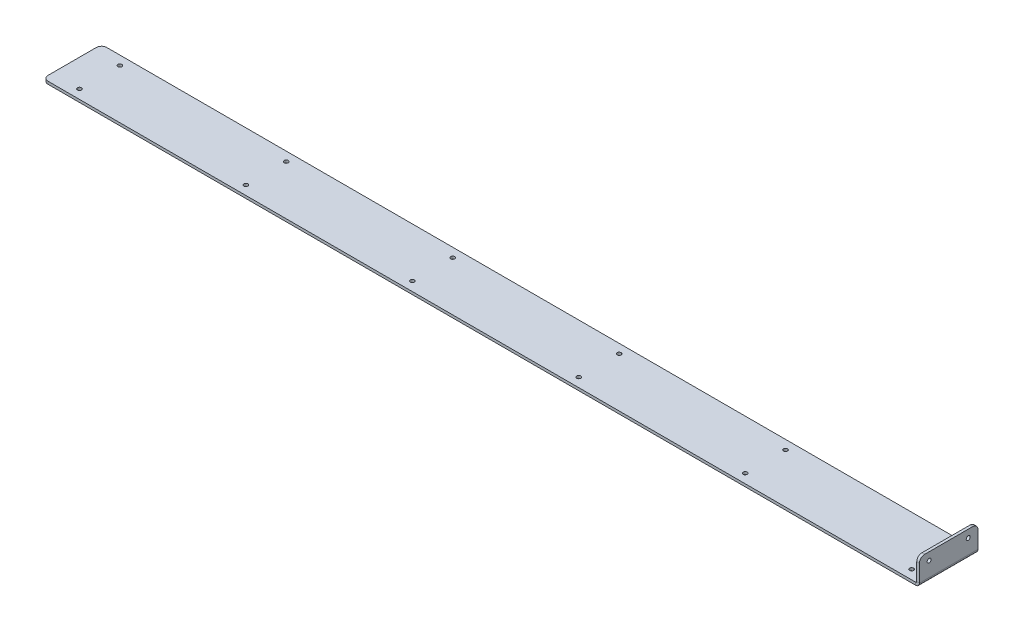
ISO-10303-21;
HEADER;
FILE_DESCRIPTION(('STEP AP214'),'2;1');
FILE_NAME('part.step','',(''),(''),'','','');
FILE_SCHEMA(('AUTOMOTIVE_DESIGN { 1 0 10303 214 1 1 1 1 }'));
ENDSEC;
DATA;
#1=APPLICATION_CONTEXT('core data for automotive mechanical design processes');
#2=APPLICATION_PROTOCOL_DEFINITION('international standard','automotive_design',2000,#1);
#3=PRODUCT_CONTEXT('',#1,'mechanical');
#4=PRODUCT('Part','Part','',(#3));
#5=PRODUCT_RELATED_PRODUCT_CATEGORY('part','',(#4));
#6=PRODUCT_DEFINITION_FORMATION('','',#4);
#7=PRODUCT_DEFINITION_CONTEXT('part definition',#1,'design');
#8=PRODUCT_DEFINITION('design','',#6,#7);
#9=PRODUCT_DEFINITION_SHAPE('','',#8);
#10=(LENGTH_UNIT() NAMED_UNIT(*) SI_UNIT(.MILLI.,.METRE.));
#11=(NAMED_UNIT(*) PLANE_ANGLE_UNIT() SI_UNIT($,.RADIAN.));
#12=(NAMED_UNIT(*) SI_UNIT($,.STERADIAN.) SOLID_ANGLE_UNIT());
#13=UNCERTAINTY_MEASURE_WITH_UNIT(LENGTH_MEASURE(1.E-05),#10,'distance_accuracy_value','');
#14=(GEOMETRIC_REPRESENTATION_CONTEXT(3) GLOBAL_UNCERTAINTY_ASSIGNED_CONTEXT((#13)) GLOBAL_UNIT_ASSIGNED_CONTEXT((#10,
#11,#12)) REPRESENTATION_CONTEXT('',''));
#15=CARTESIAN_POINT('',(0.,0.,0.));
#16=DIRECTION('',(0.,0.,1.));
#17=DIRECTION('',(1.,0.,0.));
#18=AXIS2_PLACEMENT_3D('',#15,#16,#17);
#19=CARTESIAN_POINT('',(-1030.5161,0.,24.6062500000006));
#20=DIRECTION('',(0.,1.,0.));
#21=DIRECTION('',(0.,0.,1.));
#22=AXIS2_PLACEMENT_3D('',#19,#20,#21);
#23=CYLINDRICAL_SURFACE('',#22,2.45744999999999);
#24=CARTESIAN_POINT('',(-1030.5161,-3.2639,24.6062500000006));
#25=DIRECTION('',(0.,1.,0.));
#26=DIRECTION('',(0.,0.,1.));
#27=AXIS2_PLACEMENT_3D('',#24,#25,#26);
#28=CIRCLE('',#27,2.45744999999999);
#29=CARTESIAN_POINT('',(-1030.5161,-3.2639,27.0637000000006));
#30=VERTEX_POINT('',#29);
#31=EDGE_CURVE('E274',#30,#30,#28,.T.);
#32=ORIENTED_EDGE('',*,*,#31,.F.);
#33=EDGE_LOOP('',(#32));
#34=FACE_BOUND('',#33,.T.);
#35=CARTESIAN_POINT('',(-1030.5161,0.,24.6062500000006));
#36=DIRECTION('',(0.,1.,0.));
#37=DIRECTION('',(0.,0.,1.));
#38=AXIS2_PLACEMENT_3D('',#35,#36,#37);
#39=CIRCLE('',#38,2.45744999999999);
#40=CARTESIAN_POINT('',(-1030.5161,0.,27.0637000000006));
#41=VERTEX_POINT('',#40);
#42=EDGE_CURVE('E277',#41,#41,#39,.T.);
#43=ORIENTED_EDGE('',*,*,#42,.T.);
#44=EDGE_LOOP('',(#43));
#45=FACE_BOUND('',#44,.T.);
#46=ADVANCED_FACE('F58',(#34,#45),#23,.F.);
#47=CARTESIAN_POINT('',(-827.6336,0.,24.6062500000005));
#48=DIRECTION('',(0.,1.,0.));
#49=DIRECTION('',(0.,0.,1.));
#50=AXIS2_PLACEMENT_3D('',#47,#48,#49);
#51=CYLINDRICAL_SURFACE('',#50,2.45744999999999);
#52=CARTESIAN_POINT('',(-827.6336,-3.2639,24.6062500000005));
#53=DIRECTION('',(0.,1.,0.));
#54=DIRECTION('',(0.,0.,1.));
#55=AXIS2_PLACEMENT_3D('',#52,#53,#54);
#56=CIRCLE('',#55,2.45744999999999);
#57=CARTESIAN_POINT('',(-827.6336,-3.2639,27.0637000000005));
#58=VERTEX_POINT('',#57);
#59=EDGE_CURVE('E268',#58,#58,#56,.T.);
#60=ORIENTED_EDGE('',*,*,#59,.F.);
#61=EDGE_LOOP('',(#60));
#62=FACE_BOUND('',#61,.T.);
#63=CARTESIAN_POINT('',(-827.6336,0.,24.6062500000005));
#64=DIRECTION('',(0.,1.,0.));
#65=DIRECTION('',(0.,0.,1.));
#66=AXIS2_PLACEMENT_3D('',#63,#64,#65);
#67=CIRCLE('',#66,2.45744999999999);
#68=CARTESIAN_POINT('',(-827.6336,0.,27.0637000000005));
#69=VERTEX_POINT('',#68);
#70=EDGE_CURVE('E271',#69,#69,#67,.T.);
#71=ORIENTED_EDGE('',*,*,#70,.T.);
#72=EDGE_LOOP('',(#71));
#73=FACE_BOUND('',#72,.T.);
#74=ADVANCED_FACE('F357',(#62,#73),#51,.F.);
#75=CARTESIAN_POINT('',(-624.7511,0.,24.6062500000004));
#76=DIRECTION('',(0.,1.,0.));
#77=DIRECTION('',(0.,0.,1.));
#78=AXIS2_PLACEMENT_3D('',#75,#76,#77);
#79=CYLINDRICAL_SURFACE('',#78,2.45744999999999);
#80=CARTESIAN_POINT('',(-624.7511,-3.2639,24.6062500000004));
#81=DIRECTION('',(0.,1.,0.));
#82=DIRECTION('',(0.,0.,1.));
#83=AXIS2_PLACEMENT_3D('',#80,#81,#82);
#84=CIRCLE('',#83,2.45744999999999);
#85=CARTESIAN_POINT('',(-624.7511,-3.2639,27.0637000000004));
#86=VERTEX_POINT('',#85);
#87=EDGE_CURVE('E262',#86,#86,#84,.T.);
#88=ORIENTED_EDGE('',*,*,#87,.F.);
#89=EDGE_LOOP('',(#88));
#90=FACE_BOUND('',#89,.T.);
#91=CARTESIAN_POINT('',(-624.7511,0.,24.6062500000004));
#92=DIRECTION('',(0.,1.,0.));
#93=DIRECTION('',(0.,0.,1.));
#94=AXIS2_PLACEMENT_3D('',#91,#92,#93);
#95=CIRCLE('',#94,2.45744999999999);
#96=CARTESIAN_POINT('',(-624.7511,0.,27.0637000000004));
#97=VERTEX_POINT('',#96);
#98=EDGE_CURVE('E265',#97,#97,#95,.T.);
#99=ORIENTED_EDGE('',*,*,#98,.T.);
#100=EDGE_LOOP('',(#99));
#101=FACE_BOUND('',#100,.T.);
#102=ADVANCED_FACE('F363',(#90,#101),#79,.F.);
#103=CARTESIAN_POINT('',(-421.8686,0.,24.6062500000002));
#104=DIRECTION('',(0.,1.,0.));
#105=DIRECTION('',(0.,0.,1.));
#106=AXIS2_PLACEMENT_3D('',#103,#104,#105);
#107=CYLINDRICAL_SURFACE('',#106,2.45744999999999);
#108=CARTESIAN_POINT('',(-421.8686,-3.2639,24.6062500000002));
#109=DIRECTION('',(0.,1.,0.));
#110=DIRECTION('',(0.,0.,1.));
#111=AXIS2_PLACEMENT_3D('',#108,#109,#110);
#112=CIRCLE('',#111,2.45744999999999);
#113=CARTESIAN_POINT('',(-421.8686,-3.2639,27.0637000000002));
#114=VERTEX_POINT('',#113);
#115=EDGE_CURVE('E256',#114,#114,#112,.T.);
#116=ORIENTED_EDGE('',*,*,#115,.F.);
#117=EDGE_LOOP('',(#116));
#118=FACE_BOUND('',#117,.T.);
#119=CARTESIAN_POINT('',(-421.8686,0.,24.6062500000002));
#120=DIRECTION('',(0.,1.,0.));
#121=DIRECTION('',(0.,0.,1.));
#122=AXIS2_PLACEMENT_3D('',#119,#120,#121);
#123=CIRCLE('',#122,2.45744999999999);
#124=CARTESIAN_POINT('',(-421.8686,0.,27.0637000000002));
#125=VERTEX_POINT('',#124);
#126=EDGE_CURVE('E259',#125,#125,#123,.T.);
#127=ORIENTED_EDGE('',*,*,#126,.T.);
#128=EDGE_LOOP('',(#127));
#129=FACE_BOUND('',#128,.T.);
#130=ADVANCED_FACE('F371',(#118,#129),#107,.F.);
#131=CARTESIAN_POINT('',(-1030.5161,0.,-24.6062499999994));
#132=DIRECTION('',(0.,1.,0.));
#133=DIRECTION('',(0.,0.,1.));
#134=AXIS2_PLACEMENT_3D('',#131,#132,#133);
#135=CYLINDRICAL_SURFACE('',#134,2.45744999999999);
#136=CARTESIAN_POINT('',(-1030.5161,-3.2639,-24.6062499999994));
#137=DIRECTION('',(0.,1.,0.));
#138=DIRECTION('',(0.,0.,1.));
#139=AXIS2_PLACEMENT_3D('',#136,#137,#138);
#140=CIRCLE('',#139,2.45744999999999);
#141=CARTESIAN_POINT('',(-1030.5161,-3.2639,-22.1487999999994));
#142=VERTEX_POINT('',#141);
#143=EDGE_CURVE('E250',#142,#142,#140,.T.);
#144=ORIENTED_EDGE('',*,*,#143,.F.);
#145=EDGE_LOOP('',(#144));
#146=FACE_BOUND('',#145,.T.);
#147=CARTESIAN_POINT('',(-1030.5161,0.,-24.6062499999994));
#148=DIRECTION('',(0.,1.,0.));
#149=DIRECTION('',(0.,0.,1.));
#150=AXIS2_PLACEMENT_3D('',#147,#148,#149);
#151=CIRCLE('',#150,2.45744999999999);
#152=CARTESIAN_POINT('',(-1030.5161,0.,-22.1487999999994));
#153=VERTEX_POINT('',#152);
#154=EDGE_CURVE('E253',#153,#153,#151,.T.);
#155=ORIENTED_EDGE('',*,*,#154,.T.);
#156=EDGE_LOOP('',(#155));
#157=FACE_BOUND('',#156,.T.);
#158=ADVANCED_FACE('F375',(#146,#157),#135,.F.);
#159=CARTESIAN_POINT('',(-827.6336,0.,-24.6062499999995));
#160=DIRECTION('',(0.,1.,0.));
#161=DIRECTION('',(0.,0.,1.));
#162=AXIS2_PLACEMENT_3D('',#159,#160,#161);
#163=CYLINDRICAL_SURFACE('',#162,2.45744999999999);
#164=CARTESIAN_POINT('',(-827.6336,-3.2639,-24.6062499999995));
#165=DIRECTION('',(0.,1.,0.));
#166=DIRECTION('',(0.,0.,1.));
#167=AXIS2_PLACEMENT_3D('',#164,#165,#166);
#168=CIRCLE('',#167,2.45744999999999);
#169=CARTESIAN_POINT('',(-827.6336,-3.2639,-22.1487999999995));
#170=VERTEX_POINT('',#169);
#171=EDGE_CURVE('E244',#170,#170,#168,.T.);
#172=ORIENTED_EDGE('',*,*,#171,.F.);
#173=EDGE_LOOP('',(#172));
#174=FACE_BOUND('',#173,.T.);
#175=CARTESIAN_POINT('',(-827.6336,0.,-24.6062499999995));
#176=DIRECTION('',(0.,1.,0.));
#177=DIRECTION('',(0.,0.,1.));
#178=AXIS2_PLACEMENT_3D('',#175,#176,#177);
#179=CIRCLE('',#178,2.45744999999999);
#180=CARTESIAN_POINT('',(-827.6336,0.,-22.1487999999995));
#181=VERTEX_POINT('',#180);
#182=EDGE_CURVE('E247',#181,#181,#179,.T.);
#183=ORIENTED_EDGE('',*,*,#182,.T.);
#184=EDGE_LOOP('',(#183));
#185=FACE_BOUND('',#184,.T.);
#186=ADVANCED_FACE('F379',(#174,#185),#163,.F.);
#187=CARTESIAN_POINT('',(-624.7511,0.,-24.6062499999996));
#188=DIRECTION('',(0.,1.,0.));
#189=DIRECTION('',(0.,0.,1.));
#190=AXIS2_PLACEMENT_3D('',#187,#188,#189);
#191=CYLINDRICAL_SURFACE('',#190,2.45744999999999);
#192=CARTESIAN_POINT('',(-624.7511,-3.2639,-24.6062499999996));
#193=DIRECTION('',(0.,1.,0.));
#194=DIRECTION('',(0.,0.,1.));
#195=AXIS2_PLACEMENT_3D('',#192,#193,#194);
#196=CIRCLE('',#195,2.45744999999999);
#197=CARTESIAN_POINT('',(-624.7511,-3.2639,-22.1487999999996));
#198=VERTEX_POINT('',#197);
#199=EDGE_CURVE('E238',#198,#198,#196,.T.);
#200=ORIENTED_EDGE('',*,*,#199,.F.);
#201=EDGE_LOOP('',(#200));
#202=FACE_BOUND('',#201,.T.);
#203=CARTESIAN_POINT('',(-624.7511,0.,-24.6062499999996));
#204=DIRECTION('',(0.,1.,0.));
#205=DIRECTION('',(0.,0.,1.));
#206=AXIS2_PLACEMENT_3D('',#203,#204,#205);
#207=CIRCLE('',#206,2.45744999999999);
#208=CARTESIAN_POINT('',(-624.7511,0.,-22.1487999999996));
#209=VERTEX_POINT('',#208);
#210=EDGE_CURVE('E241',#209,#209,#207,.T.);
#211=ORIENTED_EDGE('',*,*,#210,.T.);
#212=EDGE_LOOP('',(#211));
#213=FACE_BOUND('',#212,.T.);
#214=ADVANCED_FACE('F383',(#202,#213),#191,.F.);
#215=CARTESIAN_POINT('',(-421.8686,0.,-24.6062499999998));
#216=DIRECTION('',(0.,1.,0.));
#217=DIRECTION('',(0.,0.,1.));
#218=AXIS2_PLACEMENT_3D('',#215,#216,#217);
#219=CYLINDRICAL_SURFACE('',#218,2.45744999999999);
#220=CARTESIAN_POINT('',(-421.8686,-3.2639,-24.6062499999998));
#221=DIRECTION('',(0.,1.,0.));
#222=DIRECTION('',(0.,0.,1.));
#223=AXIS2_PLACEMENT_3D('',#220,#221,#222);
#224=CIRCLE('',#223,2.45744999999999);
#225=CARTESIAN_POINT('',(-421.8686,-3.2639,-22.1487999999998));
#226=VERTEX_POINT('',#225);
#227=EDGE_CURVE('E230',#226,#226,#224,.T.);
#228=ORIENTED_EDGE('',*,*,#227,.F.);
#229=EDGE_LOOP('',(#228));
#230=FACE_BOUND('',#229,.T.);
#231=CARTESIAN_POINT('',(-421.8686,0.,-24.6062499999998));
#232=DIRECTION('',(0.,1.,0.));
#233=DIRECTION('',(0.,0.,1.));
#234=AXIS2_PLACEMENT_3D('',#231,#232,#233);
#235=CIRCLE('',#234,2.45744999999999);
#236=CARTESIAN_POINT('',(-421.8686,0.,-22.1487999999998));
#237=VERTEX_POINT('',#236);
#238=EDGE_CURVE('E235',#237,#237,#235,.T.);
#239=ORIENTED_EDGE('',*,*,#238,.T.);
#240=EDGE_LOOP('',(#239));
#241=FACE_BOUND('',#240,.T.);
#242=ADVANCED_FACE('F387',(#230,#241),#219,.F.);
#243=CARTESIAN_POINT('',(-1063.92345,-3.2639,-35.7187499999993));
#244=DIRECTION('',(-1.,0.,0.));
#245=DIRECTION('',(0.,0.,1.));
#246=AXIS2_PLACEMENT_3D('',#243,#244,#245);
#247=PLANE('',#246);
#248=DIRECTION('',(0.,0.,1.));
#249=VECTOR('',#248,1.);
#250=CARTESIAN_POINT('',(-1063.92345,-3.2639,-35.7187499999993));
#251=LINE('',#250,#249);
#252=CARTESIAN_POINT('',(-1063.92345,-3.2639,-29.3687499999994));
#253=VERTEX_POINT('',#252);
#254=CARTESIAN_POINT('',(-1063.92345,-3.2639,29.36875));
#255=VERTEX_POINT('',#254);
#256=EDGE_CURVE('E210',#253,#255,#251,.T.);
#257=ORIENTED_EDGE('',*,*,#256,.T.);
#258=DIRECTION('',(0.,1.,0.));
#259=VECTOR('',#258,1.);
#260=CARTESIAN_POINT('',(-1063.92345,-3.2639,29.36875));
#261=LINE('',#260,#259);
#262=CARTESIAN_POINT('',(-1063.92345,0.,29.36875));
#263=VERTEX_POINT('',#262);
#264=EDGE_CURVE('E299',#255,#263,#261,.T.);
#265=ORIENTED_EDGE('',*,*,#264,.T.);
#266=DIRECTION('',(0.,0.,1.));
#267=VECTOR('',#266,1.);
#268=CARTESIAN_POINT('',(-1063.92345,0.,-35.7187499999993));
#269=LINE('',#268,#267);
#270=CARTESIAN_POINT('',(-1063.92345,0.,-29.3687499999994));
#271=VERTEX_POINT('',#270);
#272=EDGE_CURVE('E205',#271,#263,#269,.T.);
#273=ORIENTED_EDGE('',*,*,#272,.F.);
#274=DIRECTION('',(0.,1.,0.));
#275=VECTOR('',#274,1.);
#276=CARTESIAN_POINT('',(-1063.92345,-3.2639,-29.3687499999994));
#277=LINE('',#276,#275);
#278=EDGE_CURVE('E297',#271,#253,#277,.F.);
#279=ORIENTED_EDGE('',*,*,#278,.T.);
#280=EDGE_LOOP('',(#257,#265,#273,#279));
#281=FACE_BOUND('',#280,.T.);
#282=ADVANCED_FACE('F313',(#281),#247,.T.);
#283=CARTESIAN_POINT('',(-1063.92345,-3.2639,-35.7187499999993));
#284=DIRECTION('',(0.,0.,-1.));
#285=DIRECTION('',(-1.,0.,0.));
#286=AXIS2_PLACEMENT_3D('',#283,#284,#285);
#287=PLANE('',#286);
#288=DIRECTION('',(-1.,0.,0.));
#289=VECTOR('',#288,1.);
#290=CARTESIAN_POINT('',(-1063.92345,-3.2639,-35.7187499999993));
#291=LINE('',#290,#289);
#292=CARTESIAN_POINT('',(0.,-3.2639,-35.71875));
#293=VERTEX_POINT('',#292);
#294=CARTESIAN_POINT('',(-1057.57345,-3.2639,-35.7187499999994));
#295=VERTEX_POINT('',#294);
#296=EDGE_CURVE('E217',#293,#295,#291,.T.);
#297=ORIENTED_EDGE('',*,*,#296,.T.);
#298=DIRECTION('',(0.,1.,0.));
#299=VECTOR('',#298,1.);
#300=CARTESIAN_POINT('',(-1057.57345,-3.2639,-35.7187499999994));
#301=LINE('',#300,#299);
#302=CARTESIAN_POINT('',(-1057.57345,0.,-35.7187499999994));
#303=VERTEX_POINT('',#302);
#304=EDGE_CURVE('E13',#295,#303,#301,.T.);
#305=ORIENTED_EDGE('',*,*,#304,.T.);
#306=DIRECTION('',(-1.,0.,0.));
#307=VECTOR('',#306,1.);
#308=CARTESIAN_POINT('',(-1063.92345,0.,-35.7187499999993));
#309=LINE('',#308,#307);
#310=CARTESIAN_POINT('',(0.,0.,-35.71875));
#311=VERTEX_POINT('',#310);
#312=EDGE_CURVE('E214',#311,#303,#309,.T.);
#313=ORIENTED_EDGE('',*,*,#312,.F.);
#314=DIRECTION('',(0.,1.,0.));
#315=VECTOR('',#314,1.);
#316=CARTESIAN_POINT('',(0.,-3.2639,-35.71875));
#317=LINE('',#316,#315);
#318=EDGE_CURVE('E228',#293,#311,#317,.T.);
#319=ORIENTED_EDGE('',*,*,#318,.F.);
#320=EDGE_LOOP('',(#297,#305,#313,#319));
#321=FACE_BOUND('',#320,.T.);
#322=ADVANCED_FACE('F394',(#321),#287,.T.);
#323=CARTESIAN_POINT('',(-1063.92345,-3.2639,35.71875));
#324=DIRECTION('',(0.,0.,1.));
#325=DIRECTION('',(1.,0.,0.));
#326=AXIS2_PLACEMENT_3D('',#323,#324,#325);
#327=PLANE('',#326);
#328=DIRECTION('',(1.,0.,0.));
#329=VECTOR('',#328,1.);
#330=CARTESIAN_POINT('',(-1063.92345,0.,35.71875));
#331=LINE('',#330,#329);
#332=CARTESIAN_POINT('',(-1057.57345,0.,35.71875));
#333=VERTEX_POINT('',#332);
#334=CARTESIAN_POINT('',(0.,0.,35.71875));
#335=VERTEX_POINT('',#334);
#336=EDGE_CURVE('E222',#333,#335,#331,.T.);
#337=ORIENTED_EDGE('',*,*,#336,.F.);
#338=DIRECTION('',(0.,1.,0.));
#339=VECTOR('',#338,1.);
#340=CARTESIAN_POINT('',(-1057.57345,-3.2639,35.71875));
#341=LINE('',#340,#339);
#342=CARTESIAN_POINT('',(-1057.57345,-3.2639,35.71875));
#343=VERTEX_POINT('',#342);
#344=EDGE_CURVE('E81',#333,#343,#341,.F.);
#345=ORIENTED_EDGE('',*,*,#344,.T.);
#346=DIRECTION('',(1.,0.,0.));
#347=VECTOR('',#346,1.);
#348=CARTESIAN_POINT('',(-1063.92345,-3.2639,35.71875));
#349=LINE('',#348,#347);
#350=CARTESIAN_POINT('',(0.,-3.2639,35.71875));
#351=VERTEX_POINT('',#350);
#352=EDGE_CURVE('E213',#343,#351,#349,.T.);
#353=ORIENTED_EDGE('',*,*,#352,.T.);
#354=DIRECTION('',(0.,1.,0.));
#355=VECTOR('',#354,1.);
#356=CARTESIAN_POINT('',(0.,-3.2639,35.71875));
#357=LINE('',#356,#355);
#358=EDGE_CURVE('E219',#351,#335,#357,.T.);
#359=ORIENTED_EDGE('',*,*,#358,.T.);
#360=EDGE_LOOP('',(#337,#345,#353,#359));
#361=FACE_BOUND('',#360,.T.);
#362=ADVANCED_FACE('F320',(#361),#327,.T.);
#363=CARTESIAN_POINT('',(0.,-3.2639,0.));
#364=DIRECTION('',(0.,1.,0.));
#365=DIRECTION('',(0.,0.,1.));
#366=AXIS2_PLACEMENT_3D('',#363,#364,#365);
#367=PLANE('',#366);
#368=CARTESIAN_POINT('',(-218.9861,-3.2639,24.6062500000001));
#369=DIRECTION('',(0.,1.,0.));
#370=DIRECTION('',(0.,0.,1.));
#371=AXIS2_PLACEMENT_3D('',#368,#369,#370);
#372=CIRCLE('',#371,2.45744999999999);
#373=CARTESIAN_POINT('',(-218.9861,-3.2639,27.0637000000001));
#374=VERTEX_POINT('',#373);
#375=EDGE_CURVE('E466',#374,#374,#372,.T.);
#376=ORIENTED_EDGE('',*,*,#375,.T.);
#377=EDGE_LOOP('',(#376));
#378=FACE_BOUND('',#377,.T.);
#379=CARTESIAN_POINT('',(-218.9861,-3.2639,-24.6062499999999));
#380=DIRECTION('',(0.,1.,0.));
#381=DIRECTION('',(0.,0.,1.));
#382=AXIS2_PLACEMENT_3D('',#379,#380,#381);
#383=CIRCLE('',#382,2.45744999999999);
#384=CARTESIAN_POINT('',(-218.9861,-3.2639,-22.1487999999999));
#385=VERTEX_POINT('',#384);
#386=EDGE_CURVE('E472',#385,#385,#383,.T.);
#387=ORIENTED_EDGE('',*,*,#386,.T.);
#388=EDGE_LOOP('',(#387));
#389=FACE_BOUND('',#388,.T.);
#390=CARTESIAN_POINT('',(-16.1035999999999,-3.2639,-24.60625));
#391=DIRECTION('',(0.,1.,0.));
#392=DIRECTION('',(0.,0.,1.));
#393=AXIS2_PLACEMENT_3D('',#390,#391,#392);
#394=CIRCLE('',#393,2.45744999999999);
#395=CARTESIAN_POINT('',(-16.1035999999999,-3.2639,-22.1488));
#396=VERTEX_POINT('',#395);
#397=EDGE_CURVE('E481',#396,#396,#394,.T.);
#398=ORIENTED_EDGE('',*,*,#397,.T.);
#399=EDGE_LOOP('',(#398));
#400=FACE_BOUND('',#399,.T.);
#401=CARTESIAN_POINT('',(-16.1035999999999,-3.2639,24.60625));
#402=DIRECTION('',(0.,1.,0.));
#403=DIRECTION('',(0.,0.,1.));
#404=AXIS2_PLACEMENT_3D('',#401,#402,#403);
#405=CIRCLE('',#404,2.45744999999999);
#406=CARTESIAN_POINT('',(-16.1035999999999,-3.2639,27.0637));
#407=VERTEX_POINT('',#406);
#408=EDGE_CURVE('E204',#407,#407,#405,.T.);
#409=ORIENTED_EDGE('',*,*,#408,.T.);
#410=EDGE_LOOP('',(#409));
#411=FACE_BOUND('',#410,.T.);
#412=ORIENTED_EDGE('',*,*,#352,.F.);
#413=CARTESIAN_POINT('',(-1057.57345,-3.2639,29.36875));
#414=DIRECTION('',(0.,1.,0.));
#415=DIRECTION('',(0.,0.,1.));
#416=AXIS2_PLACEMENT_3D('',#413,#414,#415);
#417=CIRCLE('',#416,6.35);
#418=EDGE_CURVE('E66',#343,#255,#417,.F.);
#419=ORIENTED_EDGE('',*,*,#418,.T.);
#420=ORIENTED_EDGE('',*,*,#256,.F.);
#421=CARTESIAN_POINT('',(-1057.57345,-3.2639,-29.3687499999994));
#422=DIRECTION('',(0.,1.,0.));
#423=DIRECTION('',(0.,0.,1.));
#424=AXIS2_PLACEMENT_3D('',#421,#422,#423);
#425=CIRCLE('',#424,6.35);
#426=EDGE_CURVE('E73',#253,#295,#425,.F.);
#427=ORIENTED_EDGE('',*,*,#426,.T.);
#428=ORIENTED_EDGE('',*,*,#296,.F.);
#429=DIRECTION('',(0.,0.,-1.));
#430=VECTOR('',#429,1.);
#431=CARTESIAN_POINT('',(0.,-3.2639,-35.71875));
#432=LINE('',#431,#430);
#433=EDGE_CURVE('E158',#351,#293,#432,.T.);
#434=ORIENTED_EDGE('',*,*,#433,.F.);
#435=EDGE_LOOP('',(#412,#419,#420,#427,#428,#434));
#436=FACE_BOUND('',#435,.T.);
#437=ORIENTED_EDGE('',*,*,#227,.T.);
#438=EDGE_LOOP('',(#437));
#439=FACE_BOUND('',#438,.T.);
#440=ORIENTED_EDGE('',*,*,#199,.T.);
#441=EDGE_LOOP('',(#440));
#442=FACE_BOUND('',#441,.T.);
#443=ORIENTED_EDGE('',*,*,#171,.T.);
#444=EDGE_LOOP('',(#443));
#445=FACE_BOUND('',#444,.T.);
#446=ORIENTED_EDGE('',*,*,#143,.T.);
#447=EDGE_LOOP('',(#446));
#448=FACE_BOUND('',#447,.T.);
#449=ORIENTED_EDGE('',*,*,#115,.T.);
#450=EDGE_LOOP('',(#449));
#451=FACE_BOUND('',#450,.T.);
#452=ORIENTED_EDGE('',*,*,#87,.T.);
#453=EDGE_LOOP('',(#452));
#454=FACE_BOUND('',#453,.T.);
#455=ORIENTED_EDGE('',*,*,#59,.T.);
#456=EDGE_LOOP('',(#455));
#457=FACE_BOUND('',#456,.T.);
#458=ORIENTED_EDGE('',*,*,#31,.T.);
#459=EDGE_LOOP('',(#458));
#460=FACE_BOUND('',#459,.T.);
#461=ADVANCED_FACE('F308',(#378,#389,#400,#411,#436,#439,#442,#445,#448,#451,#454,#457,#460),
#367,.F.);
#462=CARTESIAN_POINT('',(0.,0.,0.));
#463=DIRECTION('',(0.,1.,0.));
#464=DIRECTION('',(0.,0.,1.));
#465=AXIS2_PLACEMENT_3D('',#462,#463,#464);
#466=PLANE('',#465);
#467=CARTESIAN_POINT('',(-218.9861,0.,24.6062500000001));
#468=DIRECTION('',(0.,1.,0.));
#469=DIRECTION('',(0.,0.,1.));
#470=AXIS2_PLACEMENT_3D('',#467,#468,#469);
#471=CIRCLE('',#470,2.45744999999999);
#472=CARTESIAN_POINT('',(-218.9861,0.,27.0637000000001));
#473=VERTEX_POINT('',#472);
#474=EDGE_CURVE('E469',#473,#473,#471,.T.);
#475=ORIENTED_EDGE('',*,*,#474,.F.);
#476=EDGE_LOOP('',(#475));
#477=FACE_BOUND('',#476,.T.);
#478=CARTESIAN_POINT('',(-218.9861,0.,-24.6062499999999));
#479=DIRECTION('',(0.,1.,0.));
#480=DIRECTION('',(0.,0.,1.));
#481=AXIS2_PLACEMENT_3D('',#478,#479,#480);
#482=CIRCLE('',#481,2.45744999999999);
#483=CARTESIAN_POINT('',(-218.9861,0.,-22.1487999999999));
#484=VERTEX_POINT('',#483);
#485=EDGE_CURVE('E475',#484,#484,#482,.T.);
#486=ORIENTED_EDGE('',*,*,#485,.F.);
#487=EDGE_LOOP('',(#486));
#488=FACE_BOUND('',#487,.T.);
#489=CARTESIAN_POINT('',(-16.1035999999999,0.,-24.60625));
#490=DIRECTION('',(0.,1.,0.));
#491=DIRECTION('',(0.,0.,1.));
#492=AXIS2_PLACEMENT_3D('',#489,#490,#491);
#493=CIRCLE('',#492,2.45744999999999);
#494=CARTESIAN_POINT('',(-16.1035999999999,0.,-22.1488));
#495=VERTEX_POINT('',#494);
#496=EDGE_CURVE('E478',#495,#495,#493,.T.);
#497=ORIENTED_EDGE('',*,*,#496,.F.);
#498=EDGE_LOOP('',(#497));
#499=FACE_BOUND('',#498,.T.);
#500=CARTESIAN_POINT('',(-16.1035999999999,0.,24.60625));
#501=DIRECTION('',(0.,1.,0.));
#502=DIRECTION('',(0.,0.,1.));
#503=AXIS2_PLACEMENT_3D('',#500,#501,#502);
#504=CIRCLE('',#503,2.45744999999999);
#505=CARTESIAN_POINT('',(-16.1035999999999,0.,27.0637));
#506=VERTEX_POINT('',#505);
#507=EDGE_CURVE('E484',#506,#506,#504,.T.);
#508=ORIENTED_EDGE('',*,*,#507,.F.);
#509=EDGE_LOOP('',(#508));
#510=FACE_BOUND('',#509,.T.);
#511=ORIENTED_EDGE('',*,*,#272,.T.);
#512=CARTESIAN_POINT('',(-1057.57345,0.,29.36875));
#513=DIRECTION('',(0.,1.,0.));
#514=DIRECTION('',(0.,0.,1.));
#515=AXIS2_PLACEMENT_3D('',#512,#513,#514);
#516=CIRCLE('',#515,6.35);
#517=EDGE_CURVE('E304',#263,#333,#516,.T.);
#518=ORIENTED_EDGE('',*,*,#517,.T.);
#519=ORIENTED_EDGE('',*,*,#336,.T.);
#520=DIRECTION('',(0.,0.,-1.));
#521=VECTOR('',#520,1.);
#522=CARTESIAN_POINT('',(0.,0.,-35.71875));
#523=LINE('',#522,#521);
#524=EDGE_CURVE('E224',#335,#311,#523,.T.);
#525=ORIENTED_EDGE('',*,*,#524,.T.);
#526=ORIENTED_EDGE('',*,*,#312,.T.);
#527=CARTESIAN_POINT('',(-1057.57345,0.,-29.3687499999994));
#528=DIRECTION('',(0.,1.,0.));
#529=DIRECTION('',(0.,0.,1.));
#530=AXIS2_PLACEMENT_3D('',#527,#528,#529);
#531=CIRCLE('',#530,6.35);
#532=EDGE_CURVE('E302',#303,#271,#531,.T.);
#533=ORIENTED_EDGE('',*,*,#532,.T.);
#534=EDGE_LOOP('',(#511,#518,#519,#525,#526,#533));
#535=FACE_BOUND('',#534,.T.);
#536=ORIENTED_EDGE('',*,*,#238,.F.);
#537=EDGE_LOOP('',(#536));
#538=FACE_BOUND('',#537,.T.);
#539=ORIENTED_EDGE('',*,*,#210,.F.);
#540=EDGE_LOOP('',(#539));
#541=FACE_BOUND('',#540,.T.);
#542=ORIENTED_EDGE('',*,*,#182,.F.);
#543=EDGE_LOOP('',(#542));
#544=FACE_BOUND('',#543,.T.);
#545=ORIENTED_EDGE('',*,*,#154,.F.);
#546=EDGE_LOOP('',(#545));
#547=FACE_BOUND('',#546,.T.);
#548=ORIENTED_EDGE('',*,*,#126,.F.);
#549=EDGE_LOOP('',(#548));
#550=FACE_BOUND('',#549,.T.);
#551=ORIENTED_EDGE('',*,*,#98,.F.);
#552=EDGE_LOOP('',(#551));
#553=FACE_BOUND('',#552,.T.);
#554=ORIENTED_EDGE('',*,*,#70,.F.);
#555=EDGE_LOOP('',(#554));
#556=FACE_BOUND('',#555,.T.);
#557=ORIENTED_EDGE('',*,*,#42,.F.);
#558=EDGE_LOOP('',(#557));
#559=FACE_BOUND('',#558,.T.);
#560=ADVANCED_FACE('F318',(#477,#488,#499,#510,#535,#538,#541,#544,#547,#550,#553,#556,#559),
#466,.T.);
#561=CARTESIAN_POINT('',(0.,1.27,35.71875));
#562=DIRECTION('',(0.,0.,1.));
#563=DIRECTION('',(1.,0.,0.));
#564=AXIS2_PLACEMENT_3D('',#561,#562,#563);
#565=PLANE('',#564);
#566=DIRECTION('',(-1.,0.,0.));
#567=VECTOR('',#566,1.);
#568=CARTESIAN_POINT('',(4.53390000000001,1.26999999999998,35.71875));
#569=LINE('',#568,#567);
#570=CARTESIAN_POINT('',(1.27000000000001,1.27,35.71875));
#571=VERTEX_POINT('',#570);
#572=CARTESIAN_POINT('',(4.53390000000001,1.26999999999998,35.71875));
#573=VERTEX_POINT('',#572);
#574=EDGE_CURVE('E201',#571,#573,#569,.F.);
#575=ORIENTED_EDGE('',*,*,#574,.F.);
#576=CARTESIAN_POINT('',(0.,1.27,35.71875));
#577=DIRECTION('',(0.,0.,-1.));
#578=DIRECTION('',(-1.,0.,0.));
#579=AXIS2_PLACEMENT_3D('',#576,#577,#578);
#580=CIRCLE('',#579,1.27);
#581=EDGE_CURVE('E162',#335,#571,#580,.F.);
#582=ORIENTED_EDGE('',*,*,#581,.F.);
#583=ORIENTED_EDGE('',*,*,#358,.F.);
#584=CARTESIAN_POINT('',(0.,1.27,35.71875));
#585=DIRECTION('',(0.,0.,-1.));
#586=DIRECTION('',(-1.,0.,0.));
#587=AXIS2_PLACEMENT_3D('',#584,#585,#586);
#588=CIRCLE('',#587,4.5339);
#589=EDGE_CURVE('E161',#351,#573,#588,.F.);
#590=ORIENTED_EDGE('',*,*,#589,.T.);
#591=EDGE_LOOP('',(#575,#582,#583,#590));
#592=FACE_BOUND('',#591,.T.);
#593=ADVANCED_FACE('F330',(#592),#565,.T.);
#594=CARTESIAN_POINT('',(0.,1.27,-35.71875));
#595=DIRECTION('',(0.,0.,1.));
#596=DIRECTION('',(1.,0.,0.));
#597=AXIS2_PLACEMENT_3D('',#594,#595,#596);
#598=PLANE('',#597);
#599=CARTESIAN_POINT('',(0.,1.27,-35.71875));
#600=DIRECTION('',(0.,0.,-1.));
#601=DIRECTION('',(-1.,0.,0.));
#602=AXIS2_PLACEMENT_3D('',#599,#600,#601);
#603=CIRCLE('',#602,1.27);
#604=CARTESIAN_POINT('',(1.26999999999999,1.27,-35.71875));
#605=VERTEX_POINT('',#604);
#606=EDGE_CURVE('E169',#605,#311,#603,.T.);
#607=ORIENTED_EDGE('',*,*,#606,.F.);
#608=DIRECTION('',(-1.,0.,0.));
#609=VECTOR('',#608,1.);
#610=CARTESIAN_POINT('',(1.26999999999999,1.27,-35.71875));
#611=LINE('',#610,#609);
#612=CARTESIAN_POINT('',(4.53389999999999,1.26999999999998,-35.71875));
#613=VERTEX_POINT('',#612);
#614=EDGE_CURVE('E166',#605,#613,#611,.F.);
#615=ORIENTED_EDGE('',*,*,#614,.T.);
#616=CARTESIAN_POINT('',(0.,1.27,-35.71875));
#617=DIRECTION('',(0.,0.,-1.));
#618=DIRECTION('',(-1.,0.,0.));
#619=AXIS2_PLACEMENT_3D('',#616,#617,#618);
#620=CIRCLE('',#619,4.5339);
#621=EDGE_CURVE('E150',#613,#293,#620,.T.);
#622=ORIENTED_EDGE('',*,*,#621,.T.);
#623=ORIENTED_EDGE('',*,*,#318,.T.);
#624=EDGE_LOOP('',(#607,#615,#622,#623));
#625=FACE_BOUND('',#624,.T.);
#626=ADVANCED_FACE('F167',(#625),#598,.F.);
#627=CARTESIAN_POINT('',(0.,1.27,-35.71875));
#628=DIRECTION('',(0.,0.,-1.));
#629=DIRECTION('',(1.,0.,0.));
#630=AXIS2_PLACEMENT_3D('',#627,#628,#629);
#631=CYLINDRICAL_SURFACE('',#630,4.5339);
#632=ORIENTED_EDGE('',*,*,#433,.T.);
#633=ORIENTED_EDGE('',*,*,#621,.F.);
#634=DIRECTION('',(0.,0.,-1.));
#635=VECTOR('',#634,1.);
#636=CARTESIAN_POINT('',(4.53390000000001,1.26999999999998,35.71875));
#637=LINE('',#636,#635);
#638=EDGE_CURVE('E155',#613,#573,#637,.F.);
#639=ORIENTED_EDGE('',*,*,#638,.T.);
#640=ORIENTED_EDGE('',*,*,#589,.F.);
#641=EDGE_LOOP('',(#632,#633,#639,#640));
#642=FACE_BOUND('',#641,.T.);
#643=ADVANCED_FACE('F152',(#642),#631,.T.);
#644=CARTESIAN_POINT('',(0.,1.27,-35.71875));
#645=DIRECTION('',(0.,0.,-1.));
#646=DIRECTION('',(1.,0.,0.));
#647=AXIS2_PLACEMENT_3D('',#644,#645,#646);
#648=CYLINDRICAL_SURFACE('',#647,1.27);
#649=ORIENTED_EDGE('',*,*,#524,.F.);
#650=ORIENTED_EDGE('',*,*,#581,.T.);
#651=DIRECTION('',(0.,0.,-1.));
#652=VECTOR('',#651,1.);
#653=CARTESIAN_POINT('',(1.27000000000001,1.27,35.71875));
#654=LINE('',#653,#652);
#655=EDGE_CURVE('E174',#571,#605,#654,.T.);
#656=ORIENTED_EDGE('',*,*,#655,.T.);
#657=ORIENTED_EDGE('',*,*,#606,.T.);
#658=EDGE_LOOP('',(#649,#650,#656,#657));
#659=FACE_BOUND('',#658,.T.);
#660=ADVANCED_FACE('F326',(#659),#648,.F.);
#661=CARTESIAN_POINT('',(4.53390000000008,28.4861,-35.71875));
#662=DIRECTION('',(0.,0.,1.));
#663=DIRECTION('',(1.,0.,0.));
#664=AXIS2_PLACEMENT_3D('',#661,#662,#663);
#665=PLANE('',#664);
#666=DIRECTION('',(0.,-1.,0.));
#667=VECTOR('',#666,1.);
#668=CARTESIAN_POINT('',(1.27000000000008,28.4861,-35.71875));
#669=LINE('',#668,#667);
#670=CARTESIAN_POINT('',(1.27000000000006,22.1361,-35.71875));
#671=VERTEX_POINT('',#670);
#672=EDGE_CURVE('E183',#605,#671,#669,.F.);
#673=ORIENTED_EDGE('',*,*,#672,.T.);
#674=DIRECTION('',(-1.,0.,0.));
#675=VECTOR('',#674,1.);
#676=CARTESIAN_POINT('',(4.53390000000006,22.1361,-35.71875));
#677=LINE('',#676,#675);
#678=CARTESIAN_POINT('',(4.53390000000006,22.1361,-35.71875));
#679=VERTEX_POINT('',#678);
#680=EDGE_CURVE('E187',#671,#679,#677,.F.);
#681=ORIENTED_EDGE('',*,*,#680,.T.);
#682=DIRECTION('',(0.,1.,0.));
#683=VECTOR('',#682,1.);
#684=CARTESIAN_POINT('',(4.53389999999998,0.,-35.71875));
#685=LINE('',#684,#683);
#686=EDGE_CURVE('E179',#613,#679,#685,.T.);
#687=ORIENTED_EDGE('',*,*,#686,.F.);
#688=ORIENTED_EDGE('',*,*,#614,.F.);
#689=EDGE_LOOP('',(#673,#681,#687,#688));
#690=FACE_BOUND('',#689,.T.);
#691=ADVANCED_FACE('F185',(#690),#665,.F.);
#692=CARTESIAN_POINT('',(4.53390000000001,0.,35.71875));
#693=DIRECTION('',(0.,0.,-1.));
#694=DIRECTION('',(-1.,0.,0.));
#695=AXIS2_PLACEMENT_3D('',#692,#693,#694);
#696=PLANE('',#695);
#697=DIRECTION('',(0.,-1.,0.));
#698=VECTOR('',#697,1.);
#699=CARTESIAN_POINT('',(4.53390000000001,0.,35.71875));
#700=LINE('',#699,#698);
#701=CARTESIAN_POINT('',(4.53390000000008,22.1361,35.71875));
#702=VERTEX_POINT('',#701);
#703=EDGE_CURVE('E182',#702,#573,#700,.T.);
#704=ORIENTED_EDGE('',*,*,#703,.F.);
#705=DIRECTION('',(-1.,0.,0.));
#706=VECTOR('',#705,1.);
#707=CARTESIAN_POINT('',(4.53390000000008,22.1361,35.71875));
#708=LINE('',#707,#706);
#709=CARTESIAN_POINT('',(1.27000000000008,22.1361,35.71875));
#710=VERTEX_POINT('',#709);
#711=EDGE_CURVE('E294',#702,#710,#708,.T.);
#712=ORIENTED_EDGE('',*,*,#711,.T.);
#713=DIRECTION('',(0.,1.,0.));
#714=VECTOR('',#713,1.);
#715=CARTESIAN_POINT('',(1.27000000000001,0.,35.71875));
#716=LINE('',#715,#714);
#717=EDGE_CURVE('E189',#710,#571,#716,.F.);
#718=ORIENTED_EDGE('',*,*,#717,.T.);
#719=ORIENTED_EDGE('',*,*,#574,.T.);
#720=EDGE_LOOP('',(#704,#712,#718,#719));
#721=FACE_BOUND('',#720,.T.);
#722=ADVANCED_FACE('F332',(#721),#696,.F.);
#723=CARTESIAN_POINT('',(4.5339,0.,0.));
#724=DIRECTION('',(-1.,0.,0.));
#725=DIRECTION('',(0.,-1.,0.));
#726=AXIS2_PLACEMENT_3D('',#723,#724,#725);
#727=PLANE('',#726);
#728=CARTESIAN_POINT('',(4.53390000000005,19.05,-23.8125));
#729=DIRECTION('',(-1.,0.,0.));
#730=DIRECTION('',(0.,-1.,0.));
#731=AXIS2_PLACEMENT_3D('',#728,#729,#730);
#732=CIRCLE('',#731,2.45744999999999);
#733=CARTESIAN_POINT('',(4.53390000000005,16.59255,-23.8125));
#734=VERTEX_POINT('',#733);
#735=EDGE_CURVE('E453',#734,#734,#732,.T.);
#736=ORIENTED_EDGE('',*,*,#735,.T.);
#737=EDGE_LOOP('',(#736));
#738=FACE_BOUND('',#737,.T.);
#739=CARTESIAN_POINT('',(4.53390000000007,19.05,23.8125));
#740=DIRECTION('',(-1.,0.,0.));
#741=DIRECTION('',(0.,-1.,0.));
#742=AXIS2_PLACEMENT_3D('',#739,#740,#741);
#743=CIRCLE('',#742,2.45744999999999);
#744=CARTESIAN_POINT('',(4.53390000000006,16.59255,23.8125));
#745=VERTEX_POINT('',#744);
#746=EDGE_CURVE('E463',#745,#745,#743,.T.);
#747=ORIENTED_EDGE('',*,*,#746,.T.);
#748=EDGE_LOOP('',(#747));
#749=FACE_BOUND('',#748,.T.);
#750=ORIENTED_EDGE('',*,*,#686,.T.);
#751=CARTESIAN_POINT('',(4.53390000000006,22.1361,-29.36875));
#752=DIRECTION('',(-1.,0.,0.));
#753=DIRECTION('',(0.,-1.,0.));
#754=AXIS2_PLACEMENT_3D('',#751,#752,#753);
#755=CIRCLE('',#754,6.35);
#756=CARTESIAN_POINT('',(4.53390000000009,28.4861,-29.36875));
#757=VERTEX_POINT('',#756);
#758=EDGE_CURVE('E292',#679,#757,#755,.F.);
#759=ORIENTED_EDGE('',*,*,#758,.T.);
#760=DIRECTION('',(0.,0.,1.));
#761=VECTOR('',#760,1.);
#762=CARTESIAN_POINT('',(4.5339000000001,28.4861,0.));
#763=LINE('',#762,#761);
#764=CARTESIAN_POINT('',(4.5339000000001,28.4861,29.36875));
#765=VERTEX_POINT('',#764);
#766=EDGE_CURVE('E188',#757,#765,#763,.T.);
#767=ORIENTED_EDGE('',*,*,#766,.T.);
#768=CARTESIAN_POINT('',(4.53390000000008,22.1361,29.36875));
#769=DIRECTION('',(-1.,0.,0.));
#770=DIRECTION('',(0.,-1.,0.));
#771=AXIS2_PLACEMENT_3D('',#768,#769,#770);
#772=CIRCLE('',#771,6.35);
#773=EDGE_CURVE('E290',#765,#702,#772,.F.);
#774=ORIENTED_EDGE('',*,*,#773,.T.);
#775=ORIENTED_EDGE('',*,*,#703,.T.);
#776=ORIENTED_EDGE('',*,*,#638,.F.);
#777=EDGE_LOOP('',(#750,#759,#767,#774,#775,#776));
#778=FACE_BOUND('',#777,.T.);
#779=ADVANCED_FACE('F178',(#738,#749,#778),#727,.F.);
#780=CARTESIAN_POINT('',(1.27,0.,0.));
#781=DIRECTION('',(-1.,0.,0.));
#782=DIRECTION('',(0.,-1.,0.));
#783=AXIS2_PLACEMENT_3D('',#780,#781,#782);
#784=PLANE('',#783);
#785=CARTESIAN_POINT('',(1.27000000000005,19.05,-23.8125));
#786=DIRECTION('',(-1.,0.,0.));
#787=DIRECTION('',(0.,0.,1.));
#788=AXIS2_PLACEMENT_3D('',#785,#786,#787);
#789=CIRCLE('',#788,2.45744999999999);
#790=CARTESIAN_POINT('',(1.27000000000005,19.05,-21.35505));
#791=VERTEX_POINT('',#790);
#792=EDGE_CURVE('E456',#791,#791,#789,.T.);
#793=ORIENTED_EDGE('',*,*,#792,.F.);
#794=EDGE_LOOP('',(#793));
#795=FACE_BOUND('',#794,.T.);
#796=CARTESIAN_POINT('',(1.27000000000007,19.05,23.8125));
#797=DIRECTION('',(-1.,0.,0.));
#798=DIRECTION('',(0.,0.,1.));
#799=AXIS2_PLACEMENT_3D('',#796,#797,#798);
#800=CIRCLE('',#799,2.45744999999999);
#801=CARTESIAN_POINT('',(1.27000000000007,19.05,26.26995));
#802=VERTEX_POINT('',#801);
#803=EDGE_CURVE('E458',#802,#802,#800,.T.);
#804=ORIENTED_EDGE('',*,*,#803,.F.);
#805=EDGE_LOOP('',(#804));
#806=FACE_BOUND('',#805,.T.);
#807=DIRECTION('',(0.,0.,-1.));
#808=VECTOR('',#807,1.);
#809=CARTESIAN_POINT('',(1.27000000000011,28.4861,35.71875));
#810=LINE('',#809,#808);
#811=CARTESIAN_POINT('',(1.27000000000009,28.4861,-29.36875));
#812=VERTEX_POINT('',#811);
#813=CARTESIAN_POINT('',(1.2700000000001,28.4861,29.36875));
#814=VERTEX_POINT('',#813);
#815=EDGE_CURVE('E193',#812,#814,#810,.F.);
#816=ORIENTED_EDGE('',*,*,#815,.F.);
#817=CARTESIAN_POINT('',(1.27000000000006,22.1361,-29.36875));
#818=DIRECTION('',(-1.,0.,0.));
#819=DIRECTION('',(0.,-1.,0.));
#820=AXIS2_PLACEMENT_3D('',#817,#818,#819);
#821=CIRCLE('',#820,6.35);
#822=EDGE_CURVE('E287',#812,#671,#821,.T.);
#823=ORIENTED_EDGE('',*,*,#822,.T.);
#824=ORIENTED_EDGE('',*,*,#672,.F.);
#825=ORIENTED_EDGE('',*,*,#655,.F.);
#826=ORIENTED_EDGE('',*,*,#717,.F.);
#827=CARTESIAN_POINT('',(1.27000000000008,22.1361,29.36875));
#828=DIRECTION('',(-1.,0.,0.));
#829=DIRECTION('',(0.,-1.,0.));
#830=AXIS2_PLACEMENT_3D('',#827,#828,#829);
#831=CIRCLE('',#830,6.35);
#832=EDGE_CURVE('E285',#710,#814,#831,.T.);
#833=ORIENTED_EDGE('',*,*,#832,.T.);
#834=EDGE_LOOP('',(#816,#823,#824,#825,#826,#833));
#835=FACE_BOUND('',#834,.T.);
#836=ADVANCED_FACE('F337',(#795,#806,#835),#784,.T.);
#837=CARTESIAN_POINT('',(4.53390000000011,28.4861,35.71875));
#838=DIRECTION('',(0.,-1.,0.));
#839=DIRECTION('',(1.,0.,0.));
#840=AXIS2_PLACEMENT_3D('',#837,#838,#839);
#841=PLANE('',#840);
#842=ORIENTED_EDGE('',*,*,#766,.F.);
#843=DIRECTION('',(-1.,0.,0.));
#844=VECTOR('',#843,1.);
#845=CARTESIAN_POINT('',(4.53390000000009,28.4861,-29.36875));
#846=LINE('',#845,#844);
#847=EDGE_CURVE('E282',#757,#812,#846,.T.);
#848=ORIENTED_EDGE('',*,*,#847,.T.);
#849=ORIENTED_EDGE('',*,*,#815,.T.);
#850=DIRECTION('',(-1.,0.,0.));
#851=VECTOR('',#850,1.);
#852=CARTESIAN_POINT('',(4.5339000000001,28.4861,29.36875));
#853=LINE('',#852,#851);
#854=EDGE_CURVE('E280',#814,#765,#853,.F.);
#855=ORIENTED_EDGE('',*,*,#854,.T.);
#856=EDGE_LOOP('',(#842,#848,#849,#855));
#857=FACE_BOUND('',#856,.T.);
#858=ADVANCED_FACE('F344',(#857),#841,.F.);
#859=CARTESIAN_POINT('',(-16.1035999999999,0.,24.60625));
#860=DIRECTION('',(0.,1.,0.));
#861=DIRECTION('',(0.,0.,1.));
#862=AXIS2_PLACEMENT_3D('',#859,#860,#861);
#863=CYLINDRICAL_SURFACE('',#862,2.45744999999999);
#864=ORIENTED_EDGE('',*,*,#408,.F.);
#865=EDGE_LOOP('',(#864));
#866=FACE_BOUND('',#865,.T.);
#867=ORIENTED_EDGE('',*,*,#507,.T.);
#868=EDGE_LOOP('',(#867));
#869=FACE_BOUND('',#868,.T.);
#870=ADVANCED_FACE('F418',(#866,#869),#863,.F.);
#871=CARTESIAN_POINT('',(-16.1035999999999,0.,-24.60625));
#872=DIRECTION('',(0.,1.,0.));
#873=DIRECTION('',(0.,0.,1.));
#874=AXIS2_PLACEMENT_3D('',#871,#872,#873);
#875=CYLINDRICAL_SURFACE('',#874,2.45744999999999);
#876=ORIENTED_EDGE('',*,*,#397,.F.);
#877=EDGE_LOOP('',(#876));
#878=FACE_BOUND('',#877,.T.);
#879=ORIENTED_EDGE('',*,*,#496,.T.);
#880=EDGE_LOOP('',(#879));
#881=FACE_BOUND('',#880,.T.);
#882=ADVANCED_FACE('F429',(#878,#881),#875,.F.);
#883=CARTESIAN_POINT('',(-218.9861,0.,-24.6062499999999));
#884=DIRECTION('',(0.,1.,0.));
#885=DIRECTION('',(0.,0.,1.));
#886=AXIS2_PLACEMENT_3D('',#883,#884,#885);
#887=CYLINDRICAL_SURFACE('',#886,2.45744999999999);
#888=ORIENTED_EDGE('',*,*,#386,.F.);
#889=EDGE_LOOP('',(#888));
#890=FACE_BOUND('',#889,.T.);
#891=ORIENTED_EDGE('',*,*,#485,.T.);
#892=EDGE_LOOP('',(#891));
#893=FACE_BOUND('',#892,.T.);
#894=ADVANCED_FACE('F433',(#890,#893),#887,.F.);
#895=CARTESIAN_POINT('',(-218.9861,0.,24.6062500000001));
#896=DIRECTION('',(0.,1.,0.));
#897=DIRECTION('',(0.,0.,1.));
#898=AXIS2_PLACEMENT_3D('',#895,#896,#897);
#899=CYLINDRICAL_SURFACE('',#898,2.45744999999999);
#900=ORIENTED_EDGE('',*,*,#375,.F.);
#901=EDGE_LOOP('',(#900));
#902=FACE_BOUND('',#901,.T.);
#903=ORIENTED_EDGE('',*,*,#474,.T.);
#904=EDGE_LOOP('',(#903));
#905=FACE_BOUND('',#904,.T.);
#906=ADVANCED_FACE('F437',(#902,#905),#899,.F.);
#907=CARTESIAN_POINT('',(1.27000000000007,19.05,23.8125));
#908=DIRECTION('',(-1.,0.,0.));
#909=DIRECTION('',(0.,0.,1.));
#910=AXIS2_PLACEMENT_3D('',#907,#908,#909);
#911=CYLINDRICAL_SURFACE('',#910,2.45744999999999);
#912=ORIENTED_EDGE('',*,*,#746,.F.);
#913=EDGE_LOOP('',(#912));
#914=FACE_BOUND('',#913,.T.);
#915=ORIENTED_EDGE('',*,*,#803,.T.);
#916=EDGE_LOOP('',(#915));
#917=FACE_BOUND('',#916,.T.);
#918=ADVANCED_FACE('F441',(#914,#917),#911,.F.);
#919=CARTESIAN_POINT('',(1.27000000000005,19.05,-23.8125));
#920=DIRECTION('',(-1.,0.,0.));
#921=DIRECTION('',(0.,0.,1.));
#922=AXIS2_PLACEMENT_3D('',#919,#920,#921);
#923=CYLINDRICAL_SURFACE('',#922,2.45744999999999);
#924=ORIENTED_EDGE('',*,*,#735,.F.);
#925=EDGE_LOOP('',(#924));
#926=FACE_BOUND('',#925,.T.);
#927=ORIENTED_EDGE('',*,*,#792,.T.);
#928=EDGE_LOOP('',(#927));
#929=FACE_BOUND('',#928,.T.);
#930=ADVANCED_FACE('F354',(#926,#929),#923,.F.);
#931=CARTESIAN_POINT('',(4.53390000000006,22.1361,-29.36875));
#932=DIRECTION('',(-1.,0.,0.));
#933=DIRECTION('',(0.,-1.,0.));
#934=AXIS2_PLACEMENT_3D('',#931,#932,#933);
#935=CYLINDRICAL_SURFACE('',#934,6.35);
#936=ORIENTED_EDGE('',*,*,#758,.F.);
#937=ORIENTED_EDGE('',*,*,#680,.F.);
#938=ORIENTED_EDGE('',*,*,#822,.F.);
#939=ORIENTED_EDGE('',*,*,#847,.F.);
#940=EDGE_LOOP('',(#936,#937,#938,#939));
#941=FACE_BOUND('',#940,.T.);
#942=ADVANCED_FACE('F339',(#941),#935,.T.);
#943=CARTESIAN_POINT('',(4.53390000000008,22.1361,29.36875));
#944=DIRECTION('',(-1.,0.,0.));
#945=DIRECTION('',(0.,-1.,0.));
#946=AXIS2_PLACEMENT_3D('',#943,#944,#945);
#947=CYLINDRICAL_SURFACE('',#946,6.35);
#948=ORIENTED_EDGE('',*,*,#773,.F.);
#949=ORIENTED_EDGE('',*,*,#854,.F.);
#950=ORIENTED_EDGE('',*,*,#832,.F.);
#951=ORIENTED_EDGE('',*,*,#711,.F.);
#952=EDGE_LOOP('',(#948,#949,#950,#951));
#953=FACE_BOUND('',#952,.T.);
#954=ADVANCED_FACE('F347',(#953),#947,.T.);
#955=CARTESIAN_POINT('',(-1057.57345,-3.2639,29.36875));
#956=DIRECTION('',(0.,1.,0.));
#957=DIRECTION('',(0.,0.,1.));
#958=AXIS2_PLACEMENT_3D('',#955,#956,#957);
#959=CYLINDRICAL_SURFACE('',#958,6.35);
#960=ORIENTED_EDGE('',*,*,#418,.F.);
#961=ORIENTED_EDGE('',*,*,#344,.F.);
#962=ORIENTED_EDGE('',*,*,#517,.F.);
#963=ORIENTED_EDGE('',*,*,#264,.F.);
#964=EDGE_LOOP('',(#960,#961,#962,#963));
#965=FACE_BOUND('',#964,.T.);
#966=ADVANCED_FACE('F316',(#965),#959,.T.);
#967=CARTESIAN_POINT('',(-1057.57345,-3.2639,-29.3687499999994));
#968=DIRECTION('',(0.,1.,0.));
#969=DIRECTION('',(0.,0.,1.));
#970=AXIS2_PLACEMENT_3D('',#967,#968,#969);
#971=CYLINDRICAL_SURFACE('',#970,6.35);
#972=ORIENTED_EDGE('',*,*,#426,.F.);
#973=ORIENTED_EDGE('',*,*,#278,.F.);
#974=ORIENTED_EDGE('',*,*,#532,.F.);
#975=ORIENTED_EDGE('',*,*,#304,.F.);
#976=EDGE_LOOP('',(#972,#973,#974,#975));
#977=FACE_BOUND('',#976,.T.);
#978=ADVANCED_FACE('F60',(#977),#971,.T.);
#979=CLOSED_SHELL('',(#46,#74,#102,#130,#158,#186,#214,#242,#282,#322,#362,#461,#560,#593,#626,
#643,#660,#691,#722,#779,#836,#858,#870,#882,#894,#906,#918,#930,#942,#954,#966,#978));
#980=MANIFOLD_SOLID_BREP('B2',#979);
#981=ADVANCED_BREP_SHAPE_REPRESENTATION('',(#18,#980),#14);
#982=SHAPE_DEFINITION_REPRESENTATION(#9,#981);
ENDSEC;
END-ISO-10303-21;
